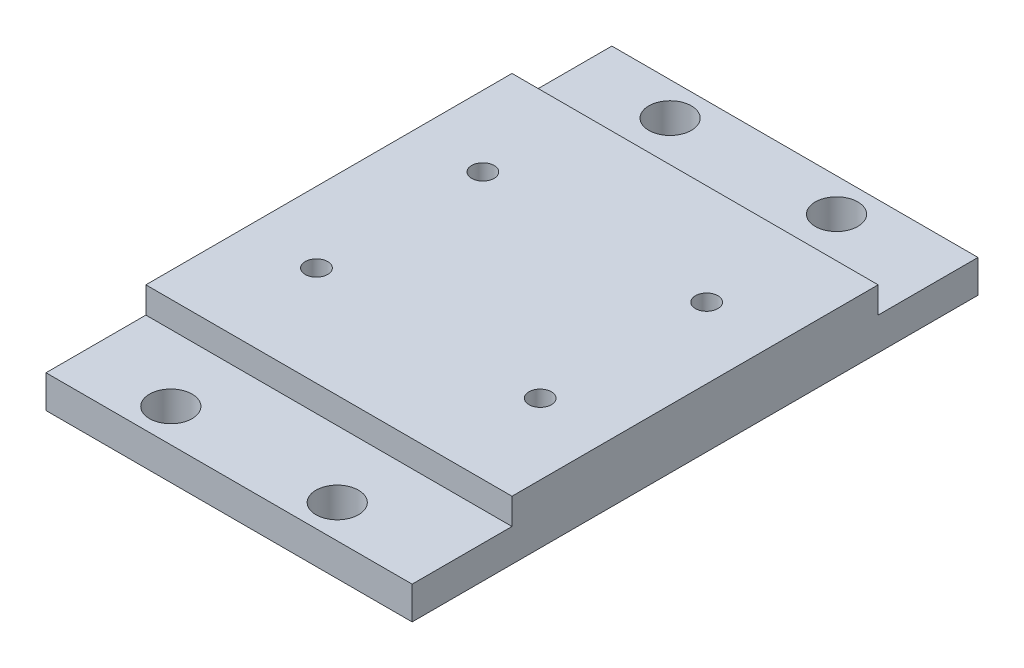
ISO-10303-21;
HEADER;
FILE_DESCRIPTION(('STEP AP214'),'2;1');
FILE_NAME('part.step','',(''),(''),'','','');
FILE_SCHEMA(('AUTOMOTIVE_DESIGN { 1 0 10303 214 1 1 1 1 }'));
ENDSEC;
DATA;
#1=APPLICATION_CONTEXT('core data for automotive mechanical design processes');
#2=APPLICATION_PROTOCOL_DEFINITION('international standard','automotive_design',2000,#1);
#3=PRODUCT_CONTEXT('',#1,'mechanical');
#4=PRODUCT('Part','Part','',(#3));
#5=PRODUCT_RELATED_PRODUCT_CATEGORY('part','',(#4));
#6=PRODUCT_DEFINITION_FORMATION('','',#4);
#7=PRODUCT_DEFINITION_CONTEXT('part definition',#1,'design');
#8=PRODUCT_DEFINITION('design','',#6,#7);
#9=PRODUCT_DEFINITION_SHAPE('','',#8);
#10=(LENGTH_UNIT() NAMED_UNIT(*) SI_UNIT(.MILLI.,.METRE.));
#11=(NAMED_UNIT(*) PLANE_ANGLE_UNIT() SI_UNIT($,.RADIAN.));
#12=(NAMED_UNIT(*) SI_UNIT($,.STERADIAN.) SOLID_ANGLE_UNIT());
#13=UNCERTAINTY_MEASURE_WITH_UNIT(LENGTH_MEASURE(1.E-05),#10,'distance_accuracy_value','');
#14=(GEOMETRIC_REPRESENTATION_CONTEXT(3) GLOBAL_UNCERTAINTY_ASSIGNED_CONTEXT((#13)) GLOBAL_UNIT_ASSIGNED_CONTEXT((#10,
#11,#12)) REPRESENTATION_CONTEXT('',''));
#15=CARTESIAN_POINT('',(0.,0.,0.));
#16=DIRECTION('',(0.,0.,1.));
#17=DIRECTION('',(1.,0.,0.));
#18=AXIS2_PLACEMENT_3D('',#15,#16,#17);
#19=CARTESIAN_POINT('',(-27.94,9.,-27.94));
#20=DIRECTION('',(0.,0.,1.));
#21=DIRECTION('',(1.,0.,0.));
#22=AXIS2_PLACEMENT_3D('',#19,#20,#21);
#23=PLANE('',#22);
#24=DIRECTION('',(1.,0.,0.));
#25=VECTOR('',#24,1.);
#26=CARTESIAN_POINT('',(27.94,5.,-27.94));
#27=LINE('',#26,#25);
#28=CARTESIAN_POINT('',(-27.94,5.,-27.94));
#29=VERTEX_POINT('',#28);
#30=CARTESIAN_POINT('',(27.94,5.,-27.94));
#31=VERTEX_POINT('',#30);
#32=EDGE_CURVE('E52',#29,#31,#27,.T.);
#33=ORIENTED_EDGE('',*,*,#32,.F.);
#34=DIRECTION('',(0.,-1.,0.));
#35=VECTOR('',#34,1.);
#36=CARTESIAN_POINT('',(-27.94,9.,-27.94));
#37=LINE('',#36,#35);
#38=CARTESIAN_POINT('',(-27.94,9.,-27.94));
#39=VERTEX_POINT('',#38);
#40=EDGE_CURVE('E46',#39,#29,#37,.T.);
#41=ORIENTED_EDGE('',*,*,#40,.F.);
#42=DIRECTION('',(-1.,0.,0.));
#43=VECTOR('',#42,1.);
#44=CARTESIAN_POINT('',(-27.94,9.,-27.94));
#45=LINE('',#44,#43);
#46=CARTESIAN_POINT('',(27.94,9.,-27.94));
#47=VERTEX_POINT('',#46);
#48=EDGE_CURVE('E231',#47,#39,#45,.T.);
#49=ORIENTED_EDGE('',*,*,#48,.F.);
#50=DIRECTION('',(0.,-1.,0.));
#51=VECTOR('',#50,1.);
#52=CARTESIAN_POINT('',(27.94,9.,-27.94));
#53=LINE('',#52,#51);
#54=EDGE_CURVE('E12',#47,#31,#53,.T.);
#55=ORIENTED_EDGE('',*,*,#54,.T.);
#56=EDGE_LOOP('',(#33,#41,#49,#55));
#57=FACE_BOUND('',#56,.T.);
#58=ADVANCED_FACE('F37',(#57),#23,.F.);
#59=CARTESIAN_POINT('',(-27.94,9.,27.94));
#60=DIRECTION('',(0.,0.,-1.));
#61=DIRECTION('',(-1.,0.,0.));
#62=AXIS2_PLACEMENT_3D('',#59,#60,#61);
#63=PLANE('',#62);
#64=DIRECTION('',(-1.,0.,0.));
#65=VECTOR('',#64,1.);
#66=CARTESIAN_POINT('',(-27.94,5.,27.94));
#67=LINE('',#66,#65);
#68=CARTESIAN_POINT('',(27.94,5.,27.94));
#69=VERTEX_POINT('',#68);
#70=CARTESIAN_POINT('',(-27.94,5.,27.94));
#71=VERTEX_POINT('',#70);
#72=EDGE_CURVE('E60',#69,#71,#67,.T.);
#73=ORIENTED_EDGE('',*,*,#72,.F.);
#74=DIRECTION('',(0.,-1.,0.));
#75=VECTOR('',#74,1.);
#76=CARTESIAN_POINT('',(27.94,9.,27.94));
#77=LINE('',#76,#75);
#78=CARTESIAN_POINT('',(27.94,9.,27.94));
#79=VERTEX_POINT('',#78);
#80=EDGE_CURVE('E236',#79,#69,#77,.T.);
#81=ORIENTED_EDGE('',*,*,#80,.F.);
#82=DIRECTION('',(1.,0.,0.));
#83=VECTOR('',#82,1.);
#84=CARTESIAN_POINT('',(-27.94,9.,27.94));
#85=LINE('',#84,#83);
#86=CARTESIAN_POINT('',(-27.94,9.,27.94));
#87=VERTEX_POINT('',#86);
#88=EDGE_CURVE('E235',#87,#79,#85,.T.);
#89=ORIENTED_EDGE('',*,*,#88,.F.);
#90=DIRECTION('',(0.,-1.,0.));
#91=VECTOR('',#90,1.);
#92=CARTESIAN_POINT('',(-27.94,9.,27.94));
#93=LINE('',#92,#91);
#94=EDGE_CURVE('E240',#87,#71,#93,.T.);
#95=ORIENTED_EDGE('',*,*,#94,.T.);
#96=EDGE_LOOP('',(#73,#81,#89,#95));
#97=FACE_BOUND('',#96,.T.);
#98=ADVANCED_FACE('F254',(#97),#63,.F.);
#99=CARTESIAN_POINT('',(17.145,9.,-12.5628963222357));
#100=DIRECTION('',(0.,1.,0.));
#101=DIRECTION('',(0.,0.,1.));
#102=AXIS2_PLACEMENT_3D('',#99,#100,#101);
#103=CYLINDRICAL_SURFACE('',#102,1.7145);
#104=CARTESIAN_POINT('',(17.145,9.,-12.5628963222357));
#105=DIRECTION('',(0.,1.,0.));
#106=DIRECTION('',(0.,0.,1.));
#107=AXIS2_PLACEMENT_3D('',#104,#105,#106);
#108=CIRCLE('',#107,1.7145);
#109=CARTESIAN_POINT('',(17.145,9.,-10.8483963222357));
#110=VERTEX_POINT('',#109);
#111=EDGE_CURVE('E139',#110,#110,#108,.T.);
#112=ORIENTED_EDGE('',*,*,#111,.T.);
#113=EDGE_LOOP('',(#112));
#114=FACE_BOUND('',#113,.T.);
#115=CARTESIAN_POINT('',(17.145,4.,-12.5628963222357));
#116=DIRECTION('',(0.,-1.,0.));
#117=DIRECTION('',(0.,0.,-1.));
#118=AXIS2_PLACEMENT_3D('',#115,#116,#117);
#119=CIRCLE('',#118,1.7145);
#120=CARTESIAN_POINT('',(17.145,4.,-14.2773963222357));
#121=VERTEX_POINT('',#120);
#122=EDGE_CURVE('E214',#121,#121,#119,.F.);
#123=ORIENTED_EDGE('',*,*,#122,.F.);
#124=EDGE_LOOP('',(#123));
#125=FACE_BOUND('',#124,.T.);
#126=ADVANCED_FACE('F277',(#114,#125),#103,.F.);
#127=CARTESIAN_POINT('',(17.145,9.,12.8371036777643));
#128=DIRECTION('',(0.,1.,0.));
#129=DIRECTION('',(0.,0.,1.));
#130=AXIS2_PLACEMENT_3D('',#127,#128,#129);
#131=CYLINDRICAL_SURFACE('',#130,1.7145);
#132=CARTESIAN_POINT('',(17.145,9.,12.8371036777643));
#133=DIRECTION('',(0.,1.,0.));
#134=DIRECTION('',(0.,0.,1.));
#135=AXIS2_PLACEMENT_3D('',#132,#133,#134);
#136=CIRCLE('',#135,1.7145);
#137=CARTESIAN_POINT('',(17.145,9.,14.5516036777643));
#138=VERTEX_POINT('',#137);
#139=EDGE_CURVE('E223',#138,#138,#136,.T.);
#140=ORIENTED_EDGE('',*,*,#139,.T.);
#141=EDGE_LOOP('',(#140));
#142=FACE_BOUND('',#141,.T.);
#143=CARTESIAN_POINT('',(17.145,4.,12.8371036777643));
#144=DIRECTION('',(0.,-1.,0.));
#145=DIRECTION('',(0.,0.,-1.));
#146=AXIS2_PLACEMENT_3D('',#143,#144,#145);
#147=CIRCLE('',#146,1.7145);
#148=CARTESIAN_POINT('',(17.145,4.,11.1226036777643));
#149=VERTEX_POINT('',#148);
#150=EDGE_CURVE('E211',#149,#149,#147,.F.);
#151=ORIENTED_EDGE('',*,*,#150,.F.);
#152=EDGE_LOOP('',(#151));
#153=FACE_BOUND('',#152,.T.);
#154=ADVANCED_FACE('F291',(#142,#153),#131,.F.);
#155=CARTESIAN_POINT('',(-17.1447259041472,9.,-12.7));
#156=DIRECTION('',(0.,1.,0.));
#157=DIRECTION('',(0.,0.,1.));
#158=AXIS2_PLACEMENT_3D('',#155,#156,#157);
#159=CYLINDRICAL_SURFACE('',#158,1.7145);
#160=CARTESIAN_POINT('',(-17.1447259041472,9.,-12.7));
#161=DIRECTION('',(0.,1.,0.));
#162=DIRECTION('',(0.,0.,1.));
#163=AXIS2_PLACEMENT_3D('',#160,#161,#162);
#164=CIRCLE('',#163,1.7145);
#165=CARTESIAN_POINT('',(-17.1447259041472,9.,-10.9855));
#166=VERTEX_POINT('',#165);
#167=EDGE_CURVE('E220',#166,#166,#164,.T.);
#168=ORIENTED_EDGE('',*,*,#167,.T.);
#169=EDGE_LOOP('',(#168));
#170=FACE_BOUND('',#169,.T.);
#171=CARTESIAN_POINT('',(-17.1447259041472,4.,-12.7));
#172=DIRECTION('',(0.,-1.,0.));
#173=DIRECTION('',(0.,0.,-1.));
#174=AXIS2_PLACEMENT_3D('',#171,#172,#173);
#175=CIRCLE('',#174,1.7145);
#176=CARTESIAN_POINT('',(-17.1447259041472,4.,-14.4145));
#177=VERTEX_POINT('',#176);
#178=EDGE_CURVE('E208',#177,#177,#175,.F.);
#179=ORIENTED_EDGE('',*,*,#178,.F.);
#180=EDGE_LOOP('',(#179));
#181=FACE_BOUND('',#180,.T.);
#182=ADVANCED_FACE('F295',(#170,#181),#159,.F.);
#183=CARTESIAN_POINT('',(-17.1447259041472,9.,12.7));
#184=DIRECTION('',(0.,1.,0.));
#185=DIRECTION('',(0.,0.,1.));
#186=AXIS2_PLACEMENT_3D('',#183,#184,#185);
#187=CYLINDRICAL_SURFACE('',#186,1.7145);
#188=CARTESIAN_POINT('',(-17.1447259041472,9.,12.7));
#189=DIRECTION('',(0.,1.,0.));
#190=DIRECTION('',(0.,0.,1.));
#191=AXIS2_PLACEMENT_3D('',#188,#189,#190);
#192=CIRCLE('',#191,1.7145);
#193=CARTESIAN_POINT('',(-17.1447259041472,9.,14.4145));
#194=VERTEX_POINT('',#193);
#195=EDGE_CURVE('E217',#194,#194,#192,.T.);
#196=ORIENTED_EDGE('',*,*,#195,.T.);
#197=EDGE_LOOP('',(#196));
#198=FACE_BOUND('',#197,.T.);
#199=CARTESIAN_POINT('',(-17.1447259041472,4.,12.7));
#200=DIRECTION('',(0.,-1.,0.));
#201=DIRECTION('',(0.,0.,-1.));
#202=AXIS2_PLACEMENT_3D('',#199,#200,#201);
#203=CIRCLE('',#202,1.7145);
#204=CARTESIAN_POINT('',(-17.1447259041472,4.,10.9855));
#205=VERTEX_POINT('',#204);
#206=EDGE_CURVE('E41',#205,#205,#203,.F.);
#207=ORIENTED_EDGE('',*,*,#206,.F.);
#208=EDGE_LOOP('',(#207));
#209=FACE_BOUND('',#208,.T.);
#210=ADVANCED_FACE('F299',(#198,#209),#187,.F.);
#211=CARTESIAN_POINT('',(27.94,9.,27.94));
#212=DIRECTION('',(-1.,0.,0.));
#213=DIRECTION('',(0.,0.,1.));
#214=AXIS2_PLACEMENT_3D('',#211,#212,#213);
#215=PLANE('',#214);
#216=DIRECTION('',(0.,0.,-1.));
#217=VECTOR('',#216,1.);
#218=CARTESIAN_POINT('',(27.94,0.,27.94));
#219=LINE('',#218,#217);
#220=CARTESIAN_POINT('',(27.94,0.,43.18));
#221=VERTEX_POINT('',#220);
#222=CARTESIAN_POINT('',(27.94,0.,-43.18));
#223=VERTEX_POINT('',#222);
#224=EDGE_CURVE('E128',#221,#223,#219,.T.);
#225=ORIENTED_EDGE('',*,*,#224,.T.);
#226=DIRECTION('',(0.,-1.,0.));
#227=VECTOR('',#226,1.);
#228=CARTESIAN_POINT('',(27.94,0.,-43.18));
#229=LINE('',#228,#227);
#230=CARTESIAN_POINT('',(27.94,5.,-43.18));
#231=VERTEX_POINT('',#230);
#232=EDGE_CURVE('E132',#231,#223,#229,.T.);
#233=ORIENTED_EDGE('',*,*,#232,.F.);
#234=DIRECTION('',(0.,0.,1.));
#235=VECTOR('',#234,1.);
#236=CARTESIAN_POINT('',(27.94,5.,-43.18));
#237=LINE('',#236,#235);
#238=EDGE_CURVE('E159',#231,#31,#237,.T.);
#239=ORIENTED_EDGE('',*,*,#238,.T.);
#240=ORIENTED_EDGE('',*,*,#54,.F.);
#241=DIRECTION('',(0.,0.,-1.));
#242=VECTOR('',#241,1.);
#243=CARTESIAN_POINT('',(27.94,9.,27.94));
#244=LINE('',#243,#242);
#245=EDGE_CURVE('E228',#79,#47,#244,.T.);
#246=ORIENTED_EDGE('',*,*,#245,.F.);
#247=ORIENTED_EDGE('',*,*,#80,.T.);
#248=DIRECTION('',(0.,0.,-1.));
#249=VECTOR('',#248,1.);
#250=CARTESIAN_POINT('',(27.94,5.,43.18));
#251=LINE('',#250,#249);
#252=CARTESIAN_POINT('',(27.94,5.,43.18));
#253=VERTEX_POINT('',#252);
#254=EDGE_CURVE('E177',#253,#69,#251,.T.);
#255=ORIENTED_EDGE('',*,*,#254,.F.);
#256=DIRECTION('',(0.,1.,0.));
#257=VECTOR('',#256,1.);
#258=CARTESIAN_POINT('',(27.94,0.,43.18));
#259=LINE('',#258,#257);
#260=EDGE_CURVE('E134',#221,#253,#259,.T.);
#261=ORIENTED_EDGE('',*,*,#260,.F.);
#262=EDGE_LOOP('',(#225,#233,#239,#240,#246,#247,#255,#261));
#263=FACE_BOUND('',#262,.T.);
#264=ADVANCED_FACE('F39',(#263),#215,.F.);
#265=CARTESIAN_POINT('',(-27.94,9.,27.94));
#266=DIRECTION('',(1.,0.,0.));
#267=DIRECTION('',(0.,0.,-1.));
#268=AXIS2_PLACEMENT_3D('',#265,#266,#267);
#269=PLANE('',#268);
#270=DIRECTION('',(0.,0.,1.));
#271=VECTOR('',#270,1.);
#272=CARTESIAN_POINT('',(-27.94,0.,27.94));
#273=LINE('',#272,#271);
#274=CARTESIAN_POINT('',(-27.94,0.,-43.18));
#275=VERTEX_POINT('',#274);
#276=CARTESIAN_POINT('',(-27.94,0.,43.18));
#277=VERTEX_POINT('',#276);
#278=EDGE_CURVE('E138',#275,#277,#273,.T.);
#279=ORIENTED_EDGE('',*,*,#278,.T.);
#280=DIRECTION('',(0.,-1.,0.));
#281=VECTOR('',#280,1.);
#282=CARTESIAN_POINT('',(-27.94,0.,43.18));
#283=LINE('',#282,#281);
#284=CARTESIAN_POINT('',(-27.94,5.,43.18));
#285=VERTEX_POINT('',#284);
#286=EDGE_CURVE('E165',#285,#277,#283,.T.);
#287=ORIENTED_EDGE('',*,*,#286,.F.);
#288=DIRECTION('',(0.,0.,-1.));
#289=VECTOR('',#288,1.);
#290=CARTESIAN_POINT('',(-27.94,5.,43.18));
#291=LINE('',#290,#289);
#292=EDGE_CURVE('E173',#285,#71,#291,.T.);
#293=ORIENTED_EDGE('',*,*,#292,.T.);
#294=ORIENTED_EDGE('',*,*,#94,.F.);
#295=DIRECTION('',(0.,0.,1.));
#296=VECTOR('',#295,1.);
#297=CARTESIAN_POINT('',(-27.94,9.,27.94));
#298=LINE('',#297,#296);
#299=EDGE_CURVE('E233',#39,#87,#298,.T.);
#300=ORIENTED_EDGE('',*,*,#299,.F.);
#301=ORIENTED_EDGE('',*,*,#40,.T.);
#302=DIRECTION('',(0.,0.,1.));
#303=VECTOR('',#302,1.);
#304=CARTESIAN_POINT('',(-27.94,5.,-43.18));
#305=LINE('',#304,#303);
#306=CARTESIAN_POINT('',(-27.94,5.,-43.18));
#307=VERTEX_POINT('',#306);
#308=EDGE_CURVE('E162',#307,#29,#305,.T.);
#309=ORIENTED_EDGE('',*,*,#308,.F.);
#310=DIRECTION('',(0.,1.,0.));
#311=VECTOR('',#310,1.);
#312=CARTESIAN_POINT('',(-27.94,0.,-43.18));
#313=LINE('',#312,#311);
#314=EDGE_CURVE('E146',#275,#307,#313,.T.);
#315=ORIENTED_EDGE('',*,*,#314,.F.);
#316=EDGE_LOOP('',(#279,#287,#293,#294,#300,#301,#309,#315));
#317=FACE_BOUND('',#316,.T.);
#318=ADVANCED_FACE('F245',(#317),#269,.F.);
#319=CARTESIAN_POINT('',(0.,9.,0.));
#320=DIRECTION('',(0.,-1.,0.));
#321=DIRECTION('',(0.,0.,-1.));
#322=AXIS2_PLACEMENT_3D('',#319,#320,#321);
#323=PLANE('',#322);
#324=ORIENTED_EDGE('',*,*,#195,.F.);
#325=EDGE_LOOP('',(#324));
#326=FACE_BOUND('',#325,.T.);
#327=ORIENTED_EDGE('',*,*,#167,.F.);
#328=EDGE_LOOP('',(#327));
#329=FACE_BOUND('',#328,.T.);
#330=ORIENTED_EDGE('',*,*,#139,.F.);
#331=EDGE_LOOP('',(#330));
#332=FACE_BOUND('',#331,.T.);
#333=ORIENTED_EDGE('',*,*,#111,.F.);
#334=EDGE_LOOP('',(#333));
#335=FACE_BOUND('',#334,.T.);
#336=ORIENTED_EDGE('',*,*,#245,.T.);
#337=ORIENTED_EDGE('',*,*,#48,.T.);
#338=ORIENTED_EDGE('',*,*,#299,.T.);
#339=ORIENTED_EDGE('',*,*,#88,.T.);
#340=EDGE_LOOP('',(#336,#337,#338,#339));
#341=FACE_BOUND('',#340,.T.);
#342=ADVANCED_FACE('F252',(#326,#329,#332,#335,#341),#323,.F.);
#343=CARTESIAN_POINT('',(0.,0.,0.));
#344=DIRECTION('',(0.,-1.,0.));
#345=DIRECTION('',(0.,0.,-1.));
#346=AXIS2_PLACEMENT_3D('',#343,#344,#345);
#347=PLANE('',#346);
#348=CARTESIAN_POINT('',(11.43,0.,-38.1));
#349=DIRECTION('',(0.,1.,0.));
#350=DIRECTION('',(0.,0.,1.));
#351=AXIS2_PLACEMENT_3D('',#348,#349,#350);
#352=CIRCLE('',#351,3.249999977);
#353=CARTESIAN_POINT('',(11.43,0.,-34.850000023));
#354=VERTEX_POINT('',#353);
#355=EDGE_CURVE('E521',#354,#354,#352,.T.);
#356=ORIENTED_EDGE('',*,*,#355,.T.);
#357=EDGE_LOOP('',(#356));
#358=FACE_BOUND('',#357,.T.);
#359=CARTESIAN_POINT('',(-13.97,0.,-38.1));
#360=DIRECTION('',(0.,1.,0.));
#361=DIRECTION('',(0.,0.,1.));
#362=AXIS2_PLACEMENT_3D('',#359,#360,#361);
#363=CIRCLE('',#362,3.249999977);
#364=CARTESIAN_POINT('',(-13.97,0.,-34.850000023));
#365=VERTEX_POINT('',#364);
#366=EDGE_CURVE('E531',#365,#365,#363,.T.);
#367=ORIENTED_EDGE('',*,*,#366,.T.);
#368=EDGE_LOOP('',(#367));
#369=FACE_BOUND('',#368,.T.);
#370=CARTESIAN_POINT('',(-13.97,0.,38.1));
#371=DIRECTION('',(0.,1.,0.));
#372=DIRECTION('',(0.,0.,1.));
#373=AXIS2_PLACEMENT_3D('',#370,#371,#372);
#374=CIRCLE('',#373,3.249999977);
#375=CARTESIAN_POINT('',(-13.97,0.,41.349999977));
#376=VERTEX_POINT('',#375);
#377=EDGE_CURVE('E537',#376,#376,#374,.T.);
#378=ORIENTED_EDGE('',*,*,#377,.T.);
#379=EDGE_LOOP('',(#378));
#380=FACE_BOUND('',#379,.T.);
#381=CARTESIAN_POINT('',(11.43,0.,38.1));
#382=DIRECTION('',(0.,1.,0.));
#383=DIRECTION('',(0.,0.,1.));
#384=AXIS2_PLACEMENT_3D('',#381,#382,#383);
#385=CIRCLE('',#384,3.249999977);
#386=CARTESIAN_POINT('',(11.43,0.,41.349999977));
#387=VERTEX_POINT('',#386);
#388=EDGE_CURVE('E153',#387,#387,#385,.T.);
#389=ORIENTED_EDGE('',*,*,#388,.T.);
#390=EDGE_LOOP('',(#389));
#391=FACE_BOUND('',#390,.T.);
#392=DIRECTION('',(0.,0.,-1.));
#393=VECTOR('',#392,1.);
#394=CARTESIAN_POINT('',(-22.1447259041472,0.,17.7));
#395=LINE('',#394,#393);
#396=CARTESIAN_POINT('',(-22.1447259041472,0.,17.7));
#397=VERTEX_POINT('',#396);
#398=CARTESIAN_POINT('',(-22.1447259041472,0.,-17.7));
#399=VERTEX_POINT('',#398);
#400=EDGE_CURVE('E180',#397,#399,#395,.T.);
#401=ORIENTED_EDGE('',*,*,#400,.F.);
#402=DIRECTION('',(-1.,0.,0.));
#403=VECTOR('',#402,1.);
#404=CARTESIAN_POINT('',(22.1447259041472,0.,17.7));
#405=LINE('',#404,#403);
#406=CARTESIAN_POINT('',(22.1447259041472,0.,17.7));
#407=VERTEX_POINT('',#406);
#408=EDGE_CURVE('E196',#407,#397,#405,.T.);
#409=ORIENTED_EDGE('',*,*,#408,.F.);
#410=DIRECTION('',(0.,0.,1.));
#411=VECTOR('',#410,1.);
#412=CARTESIAN_POINT('',(22.1447259041472,0.,17.7));
#413=LINE('',#412,#411);
#414=CARTESIAN_POINT('',(22.1447259041472,0.,-17.7));
#415=VERTEX_POINT('',#414);
#416=EDGE_CURVE('E193',#415,#407,#413,.T.);
#417=ORIENTED_EDGE('',*,*,#416,.F.);
#418=DIRECTION('',(1.,0.,0.));
#419=VECTOR('',#418,1.);
#420=CARTESIAN_POINT('',(22.1447259041472,0.,-17.7));
#421=LINE('',#420,#419);
#422=EDGE_CURVE('E190',#399,#415,#421,.T.);
#423=ORIENTED_EDGE('',*,*,#422,.F.);
#424=EDGE_LOOP('',(#401,#409,#417,#423));
#425=FACE_BOUND('',#424,.T.);
#426=ORIENTED_EDGE('',*,*,#224,.F.);
#427=DIRECTION('',(1.,0.,0.));
#428=VECTOR('',#427,1.);
#429=CARTESIAN_POINT('',(-27.94,0.,43.18));
#430=LINE('',#429,#428);
#431=EDGE_CURVE('E168',#277,#221,#430,.T.);
#432=ORIENTED_EDGE('',*,*,#431,.F.);
#433=ORIENTED_EDGE('',*,*,#278,.F.);
#434=DIRECTION('',(-1.,0.,0.));
#435=VECTOR('',#434,1.);
#436=CARTESIAN_POINT('',(27.94,0.,-43.18));
#437=LINE('',#436,#435);
#438=EDGE_CURVE('E142',#223,#275,#437,.T.);
#439=ORIENTED_EDGE('',*,*,#438,.F.);
#440=EDGE_LOOP('',(#426,#432,#433,#439));
#441=FACE_BOUND('',#440,.T.);
#442=ADVANCED_FACE('F143',(#358,#369,#380,#391,#425,#441),#347,.T.);
#443=CARTESIAN_POINT('',(0.,4.,0.));
#444=DIRECTION('',(0.,-1.,0.));
#445=DIRECTION('',(0.,0.,-1.));
#446=AXIS2_PLACEMENT_3D('',#443,#444,#445);
#447=PLANE('',#446);
#448=DIRECTION('',(0.,0.,1.));
#449=VECTOR('',#448,1.);
#450=CARTESIAN_POINT('',(-22.1447259041472,4.,17.7));
#451=LINE('',#450,#449);
#452=CARTESIAN_POINT('',(-22.1447259041472,4.,-17.7));
#453=VERTEX_POINT('',#452);
#454=CARTESIAN_POINT('',(-22.1447259041472,4.,17.7));
#455=VERTEX_POINT('',#454);
#456=EDGE_CURVE('E186',#453,#455,#451,.T.);
#457=ORIENTED_EDGE('',*,*,#456,.F.);
#458=DIRECTION('',(-1.,0.,0.));
#459=VECTOR('',#458,1.);
#460=CARTESIAN_POINT('',(22.1447259041472,4.,-17.7));
#461=LINE('',#460,#459);
#462=CARTESIAN_POINT('',(22.1447259041472,4.,-17.7));
#463=VERTEX_POINT('',#462);
#464=EDGE_CURVE('E188',#463,#453,#461,.T.);
#465=ORIENTED_EDGE('',*,*,#464,.F.);
#466=DIRECTION('',(0.,0.,-1.));
#467=VECTOR('',#466,1.);
#468=CARTESIAN_POINT('',(22.1447259041472,4.,17.7));
#469=LINE('',#468,#467);
#470=CARTESIAN_POINT('',(22.1447259041472,4.,17.7));
#471=VERTEX_POINT('',#470);
#472=EDGE_CURVE('E181',#471,#463,#469,.T.);
#473=ORIENTED_EDGE('',*,*,#472,.F.);
#474=DIRECTION('',(1.,0.,0.));
#475=VECTOR('',#474,1.);
#476=CARTESIAN_POINT('',(22.1447259041472,4.,17.7));
#477=LINE('',#476,#475);
#478=EDGE_CURVE('E183',#455,#471,#477,.T.);
#479=ORIENTED_EDGE('',*,*,#478,.F.);
#480=EDGE_LOOP('',(#457,#465,#473,#479));
#481=FACE_BOUND('',#480,.T.);
#482=ORIENTED_EDGE('',*,*,#206,.T.);
#483=EDGE_LOOP('',(#482));
#484=FACE_BOUND('',#483,.T.);
#485=ORIENTED_EDGE('',*,*,#178,.T.);
#486=EDGE_LOOP('',(#485));
#487=FACE_BOUND('',#486,.T.);
#488=ORIENTED_EDGE('',*,*,#150,.T.);
#489=EDGE_LOOP('',(#488));
#490=FACE_BOUND('',#489,.T.);
#491=ORIENTED_EDGE('',*,*,#122,.T.);
#492=EDGE_LOOP('',(#491));
#493=FACE_BOUND('',#492,.T.);
#494=ADVANCED_FACE('F284',(#481,#484,#487,#490,#493),#447,.T.);
#495=CARTESIAN_POINT('',(-22.1447259041472,65.6984615442009,17.7));
#496=DIRECTION('',(-1.,0.,0.));
#497=DIRECTION('',(0.,0.,1.));
#498=AXIS2_PLACEMENT_3D('',#495,#496,#497);
#499=PLANE('',#498);
#500=ORIENTED_EDGE('',*,*,#456,.T.);
#501=DIRECTION('',(0.,-1.,0.));
#502=VECTOR('',#501,1.);
#503=CARTESIAN_POINT('',(-22.1447259041472,65.6984615442009,17.7));
#504=LINE('',#503,#502);
#505=EDGE_CURVE('E184',#455,#397,#504,.T.);
#506=ORIENTED_EDGE('',*,*,#505,.T.);
#507=ORIENTED_EDGE('',*,*,#400,.T.);
#508=DIRECTION('',(0.,-1.,0.));
#509=VECTOR('',#508,1.);
#510=CARTESIAN_POINT('',(-22.1447259041472,65.6984615442009,-17.7));
#511=LINE('',#510,#509);
#512=EDGE_CURVE('E199',#453,#399,#511,.T.);
#513=ORIENTED_EDGE('',*,*,#512,.F.);
#514=EDGE_LOOP('',(#500,#506,#507,#513));
#515=FACE_BOUND('',#514,.T.);
#516=ADVANCED_FACE('F304',(#515),#499,.F.);
#517=CARTESIAN_POINT('',(22.1447259041472,65.6984615442009,17.7));
#518=DIRECTION('',(0.,0.,1.));
#519=DIRECTION('',(1.,0.,0.));
#520=AXIS2_PLACEMENT_3D('',#517,#518,#519);
#521=PLANE('',#520);
#522=ORIENTED_EDGE('',*,*,#478,.T.);
#523=DIRECTION('',(0.,-1.,0.));
#524=VECTOR('',#523,1.);
#525=CARTESIAN_POINT('',(22.1447259041472,65.6984615442009,17.7));
#526=LINE('',#525,#524);
#527=EDGE_CURVE('E201',#471,#407,#526,.T.);
#528=ORIENTED_EDGE('',*,*,#527,.T.);
#529=ORIENTED_EDGE('',*,*,#408,.T.);
#530=ORIENTED_EDGE('',*,*,#505,.F.);
#531=EDGE_LOOP('',(#522,#528,#529,#530));
#532=FACE_BOUND('',#531,.T.);
#533=ADVANCED_FACE('F307',(#532),#521,.F.);
#534=CARTESIAN_POINT('',(22.1447259041472,65.6984615442009,17.7));
#535=DIRECTION('',(1.,0.,0.));
#536=DIRECTION('',(0.,0.,-1.));
#537=AXIS2_PLACEMENT_3D('',#534,#535,#536);
#538=PLANE('',#537);
#539=ORIENTED_EDGE('',*,*,#472,.T.);
#540=DIRECTION('',(0.,-1.,0.));
#541=VECTOR('',#540,1.);
#542=CARTESIAN_POINT('',(22.1447259041472,65.6984615442009,-17.7));
#543=LINE('',#542,#541);
#544=EDGE_CURVE('E203',#463,#415,#543,.T.);
#545=ORIENTED_EDGE('',*,*,#544,.T.);
#546=ORIENTED_EDGE('',*,*,#416,.T.);
#547=ORIENTED_EDGE('',*,*,#527,.F.);
#548=EDGE_LOOP('',(#539,#545,#546,#547));
#549=FACE_BOUND('',#548,.T.);
#550=ADVANCED_FACE('F311',(#549),#538,.F.);
#551=CARTESIAN_POINT('',(22.1447259041472,65.6984615442009,-17.7));
#552=DIRECTION('',(0.,0.,-1.));
#553=DIRECTION('',(-1.,0.,0.));
#554=AXIS2_PLACEMENT_3D('',#551,#552,#553);
#555=PLANE('',#554);
#556=ORIENTED_EDGE('',*,*,#464,.T.);
#557=ORIENTED_EDGE('',*,*,#512,.T.);
#558=ORIENTED_EDGE('',*,*,#422,.T.);
#559=ORIENTED_EDGE('',*,*,#544,.F.);
#560=EDGE_LOOP('',(#556,#557,#558,#559));
#561=FACE_BOUND('',#560,.T.);
#562=ADVANCED_FACE('F270',(#561),#555,.F.);
#563=CARTESIAN_POINT('',(-27.94,5.,43.18));
#564=DIRECTION('',(0.,-1.,0.));
#565=DIRECTION('',(1.,0.,0.));
#566=AXIS2_PLACEMENT_3D('',#563,#564,#565);
#567=PLANE('',#566);
#568=CARTESIAN_POINT('',(-13.97,5.,38.1));
#569=DIRECTION('',(0.,1.,0.));
#570=DIRECTION('',(0.,0.,1.));
#571=AXIS2_PLACEMENT_3D('',#568,#569,#570);
#572=CIRCLE('',#571,3.249999977);
#573=CARTESIAN_POINT('',(-13.97,5.,41.349999977));
#574=VERTEX_POINT('',#573);
#575=EDGE_CURVE('E534',#574,#574,#572,.T.);
#576=ORIENTED_EDGE('',*,*,#575,.F.);
#577=EDGE_LOOP('',(#576));
#578=FACE_BOUND('',#577,.T.);
#579=CARTESIAN_POINT('',(11.43,5.,38.1));
#580=DIRECTION('',(0.,1.,0.));
#581=DIRECTION('',(0.,0.,1.));
#582=AXIS2_PLACEMENT_3D('',#579,#580,#581);
#583=CIRCLE('',#582,3.249999977);
#584=CARTESIAN_POINT('',(11.43,5.,41.349999977));
#585=VERTEX_POINT('',#584);
#586=EDGE_CURVE('E539',#585,#585,#583,.T.);
#587=ORIENTED_EDGE('',*,*,#586,.F.);
#588=EDGE_LOOP('',(#587));
#589=FACE_BOUND('',#588,.T.);
#590=ORIENTED_EDGE('',*,*,#72,.T.);
#591=ORIENTED_EDGE('',*,*,#292,.F.);
#592=DIRECTION('',(-1.,0.,0.));
#593=VECTOR('',#592,1.);
#594=CARTESIAN_POINT('',(-27.94,5.,43.18));
#595=LINE('',#594,#593);
#596=EDGE_CURVE('E171',#253,#285,#595,.T.);
#597=ORIENTED_EDGE('',*,*,#596,.F.);
#598=ORIENTED_EDGE('',*,*,#254,.T.);
#599=EDGE_LOOP('',(#590,#591,#597,#598));
#600=FACE_BOUND('',#599,.T.);
#601=ADVANCED_FACE('F257',(#578,#589,#600),#567,.F.);
#602=CARTESIAN_POINT('',(0.,0.,43.18));
#603=DIRECTION('',(0.,0.,-1.));
#604=DIRECTION('',(-1.,0.,0.));
#605=AXIS2_PLACEMENT_3D('',#602,#603,#604);
#606=PLANE('',#605);
#607=ORIENTED_EDGE('',*,*,#286,.T.);
#608=ORIENTED_EDGE('',*,*,#431,.T.);
#609=ORIENTED_EDGE('',*,*,#260,.T.);
#610=ORIENTED_EDGE('',*,*,#596,.T.);
#611=EDGE_LOOP('',(#607,#608,#609,#610));
#612=FACE_BOUND('',#611,.T.);
#613=ADVANCED_FACE('F261',(#612),#606,.F.);
#614=CARTESIAN_POINT('',(27.94,5.,-43.18));
#615=DIRECTION('',(0.,-1.,0.));
#616=DIRECTION('',(1.,0.,0.));
#617=AXIS2_PLACEMENT_3D('',#614,#615,#616);
#618=PLANE('',#617);
#619=CARTESIAN_POINT('',(11.43,5.,-38.1));
#620=DIRECTION('',(0.,1.,0.));
#621=DIRECTION('',(0.,0.,1.));
#622=AXIS2_PLACEMENT_3D('',#619,#620,#621);
#623=CIRCLE('',#622,3.249999977);
#624=CARTESIAN_POINT('',(11.43,5.,-34.850000023));
#625=VERTEX_POINT('',#624);
#626=EDGE_CURVE('E524',#625,#625,#623,.T.);
#627=ORIENTED_EDGE('',*,*,#626,.F.);
#628=EDGE_LOOP('',(#627));
#629=FACE_BOUND('',#628,.T.);
#630=CARTESIAN_POINT('',(-13.97,5.,-38.1));
#631=DIRECTION('',(0.,1.,0.));
#632=DIRECTION('',(0.,0.,1.));
#633=AXIS2_PLACEMENT_3D('',#630,#631,#632);
#634=CIRCLE('',#633,3.249999977);
#635=CARTESIAN_POINT('',(-13.97,5.,-34.850000023));
#636=VERTEX_POINT('',#635);
#637=EDGE_CURVE('E526',#636,#636,#634,.T.);
#638=ORIENTED_EDGE('',*,*,#637,.F.);
#639=EDGE_LOOP('',(#638));
#640=FACE_BOUND('',#639,.T.);
#641=ORIENTED_EDGE('',*,*,#32,.T.);
#642=ORIENTED_EDGE('',*,*,#238,.F.);
#643=DIRECTION('',(1.,0.,0.));
#644=VECTOR('',#643,1.);
#645=CARTESIAN_POINT('',(27.94,5.,-43.18));
#646=LINE('',#645,#644);
#647=EDGE_CURVE('E150',#307,#231,#646,.T.);
#648=ORIENTED_EDGE('',*,*,#647,.F.);
#649=ORIENTED_EDGE('',*,*,#308,.T.);
#650=EDGE_LOOP('',(#641,#642,#648,#649));
#651=FACE_BOUND('',#650,.T.);
#652=ADVANCED_FACE('F248',(#629,#640,#651),#618,.F.);
#653=CARTESIAN_POINT('',(0.,0.,-43.18));
#654=DIRECTION('',(0.,0.,1.));
#655=DIRECTION('',(1.,0.,0.));
#656=AXIS2_PLACEMENT_3D('',#653,#654,#655);
#657=PLANE('',#656);
#658=ORIENTED_EDGE('',*,*,#232,.T.);
#659=ORIENTED_EDGE('',*,*,#438,.T.);
#660=ORIENTED_EDGE('',*,*,#314,.T.);
#661=ORIENTED_EDGE('',*,*,#647,.T.);
#662=EDGE_LOOP('',(#658,#659,#660,#661));
#663=FACE_BOUND('',#662,.T.);
#664=ADVANCED_FACE('F148',(#663),#657,.F.);
#665=CARTESIAN_POINT('',(11.43,5.,38.1));
#666=DIRECTION('',(0.,1.,0.));
#667=DIRECTION('',(0.,0.,1.));
#668=AXIS2_PLACEMENT_3D('',#665,#666,#667);
#669=CYLINDRICAL_SURFACE('',#668,3.249999977);
#670=ORIENTED_EDGE('',*,*,#388,.F.);
#671=EDGE_LOOP('',(#670));
#672=FACE_BOUND('',#671,.T.);
#673=ORIENTED_EDGE('',*,*,#586,.T.);
#674=EDGE_LOOP('',(#673));
#675=FACE_BOUND('',#674,.T.);
#676=ADVANCED_FACE('F391',(#672,#675),#669,.F.);
#677=CARTESIAN_POINT('',(-13.97,5.,38.1));
#678=DIRECTION('',(0.,1.,0.));
#679=DIRECTION('',(0.,0.,1.));
#680=AXIS2_PLACEMENT_3D('',#677,#678,#679);
#681=CYLINDRICAL_SURFACE('',#680,3.249999977);
#682=ORIENTED_EDGE('',*,*,#377,.F.);
#683=EDGE_LOOP('',(#682));
#684=FACE_BOUND('',#683,.T.);
#685=ORIENTED_EDGE('',*,*,#575,.T.);
#686=EDGE_LOOP('',(#685));
#687=FACE_BOUND('',#686,.T.);
#688=ADVANCED_FACE('F396',(#684,#687),#681,.F.);
#689=CARTESIAN_POINT('',(-13.97,5.,-38.1));
#690=DIRECTION('',(0.,1.,0.));
#691=DIRECTION('',(0.,0.,1.));
#692=AXIS2_PLACEMENT_3D('',#689,#690,#691);
#693=CYLINDRICAL_SURFACE('',#692,3.249999977);
#694=ORIENTED_EDGE('',*,*,#366,.F.);
#695=EDGE_LOOP('',(#694));
#696=FACE_BOUND('',#695,.T.);
#697=ORIENTED_EDGE('',*,*,#637,.T.);
#698=EDGE_LOOP('',(#697));
#699=FACE_BOUND('',#698,.T.);
#700=ADVANCED_FACE('F406',(#696,#699),#693,.F.);
#701=CARTESIAN_POINT('',(11.43,5.,-38.1));
#702=DIRECTION('',(0.,1.,0.));
#703=DIRECTION('',(0.,0.,1.));
#704=AXIS2_PLACEMENT_3D('',#701,#702,#703);
#705=CYLINDRICAL_SURFACE('',#704,3.249999977);
#706=ORIENTED_EDGE('',*,*,#355,.F.);
#707=EDGE_LOOP('',(#706));
#708=FACE_BOUND('',#707,.T.);
#709=ORIENTED_EDGE('',*,*,#626,.T.);
#710=EDGE_LOOP('',(#709));
#711=FACE_BOUND('',#710,.T.);
#712=ADVANCED_FACE('F416',(#708,#711),#705,.F.);
#713=CLOSED_SHELL('',(#58,#98,#126,#154,#182,#210,#264,#318,#342,#442,#494,#516,#533,#550,#562,
#601,#613,#652,#664,#676,#688,#700,#712));
#714=MANIFOLD_SOLID_BREP('B2',#713);
#715=ADVANCED_BREP_SHAPE_REPRESENTATION('',(#18,#714),#14);
#716=SHAPE_DEFINITION_REPRESENTATION(#9,#715);
ENDSEC;
END-ISO-10303-21;
